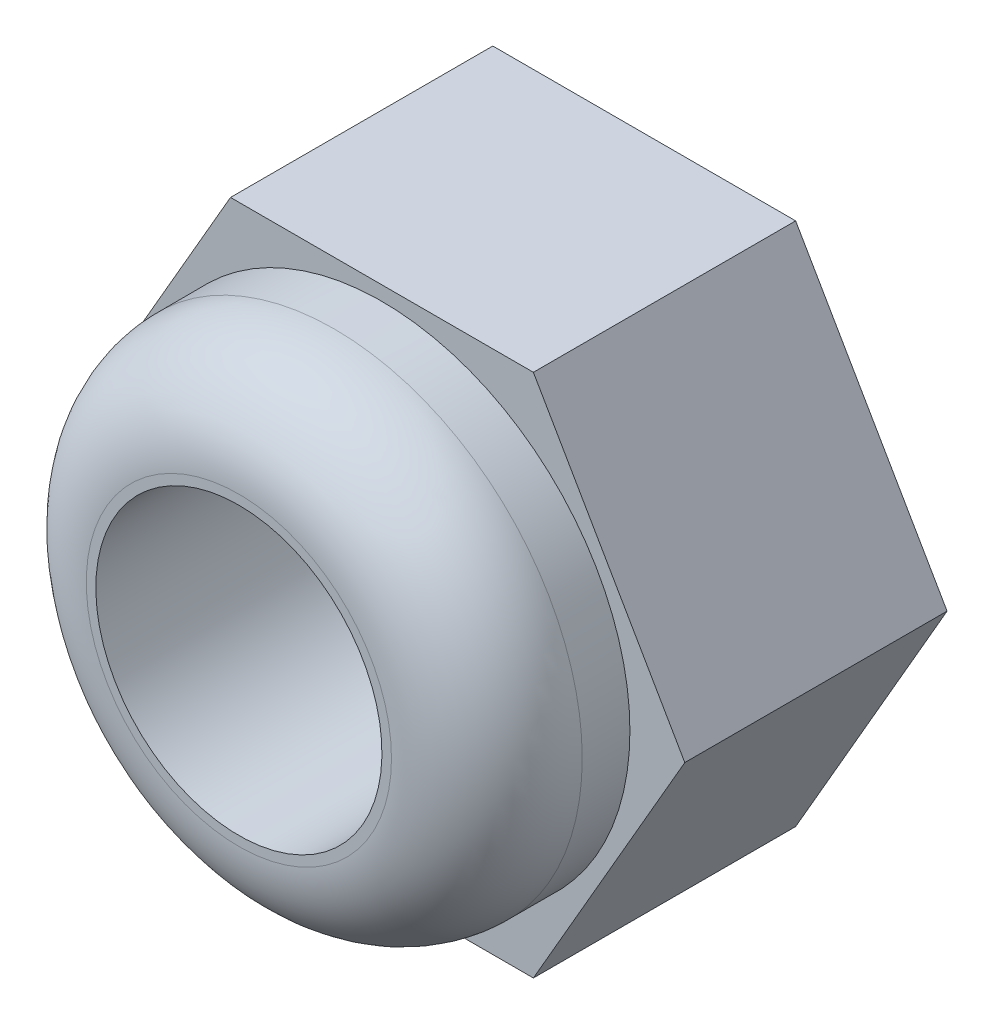
ISO-10303-21;
HEADER;
FILE_DESCRIPTION(('STEP AP214'),'2;1');
FILE_NAME('part.step','',(''),(''),'','','');
FILE_SCHEMA(('AUTOMOTIVE_DESIGN { 1 0 10303 214 1 1 1 1 }'));
ENDSEC;
DATA;
#1=APPLICATION_CONTEXT('core data for automotive mechanical design processes');
#2=APPLICATION_PROTOCOL_DEFINITION('international standard','automotive_design',2000,#1);
#3=PRODUCT_CONTEXT('',#1,'mechanical');
#4=PRODUCT('Part','Part','',(#3));
#5=PRODUCT_RELATED_PRODUCT_CATEGORY('part','',(#4));
#6=PRODUCT_DEFINITION_FORMATION('','',#4);
#7=PRODUCT_DEFINITION_CONTEXT('part definition',#1,'design');
#8=PRODUCT_DEFINITION('design','',#6,#7);
#9=PRODUCT_DEFINITION_SHAPE('','',#8);
#10=(LENGTH_UNIT() NAMED_UNIT(*) SI_UNIT(.MILLI.,.METRE.));
#11=(NAMED_UNIT(*) PLANE_ANGLE_UNIT() SI_UNIT($,.RADIAN.));
#12=(NAMED_UNIT(*) SI_UNIT($,.STERADIAN.) SOLID_ANGLE_UNIT());
#13=UNCERTAINTY_MEASURE_WITH_UNIT(LENGTH_MEASURE(1.E-05),#10,'distance_accuracy_value','');
#14=(GEOMETRIC_REPRESENTATION_CONTEXT(3) GLOBAL_UNCERTAINTY_ASSIGNED_CONTEXT((#13)) GLOBAL_UNIT_ASSIGNED_CONTEXT((#10,
#11,#12)) REPRESENTATION_CONTEXT('',''));
#15=CARTESIAN_POINT('',(0.,0.,0.));
#16=DIRECTION('',(0.,0.,1.));
#17=DIRECTION('',(1.,0.,0.));
#18=AXIS2_PLACEMENT_3D('',#15,#16,#17);
#19=CARTESIAN_POINT('',(0.,0.,2.75));
#20=DIRECTION('',(0.,0.,1.));
#21=DIRECTION('',(1.,0.,0.));
#22=AXIS2_PLACEMENT_3D('',#19,#20,#21);
#23=PLANE('',#22);
#24=CARTESIAN_POINT('',(0.,0.,2.75));
#25=DIRECTION('',(0.,0.,1.));
#26=DIRECTION('',(1.,0.,0.));
#27=AXIS2_PLACEMENT_3D('',#24,#25,#26);
#28=CIRCLE('',#27,2.6);
#29=CARTESIAN_POINT('',(2.6,0.,2.75));
#30=VERTEX_POINT('',#29);
#31=EDGE_CURVE('E20',#30,#30,#28,.T.);
#32=ORIENTED_EDGE('',*,*,#31,.F.);
#33=EDGE_LOOP('',(#32));
#34=FACE_BOUND('',#33,.T.);
#35=DIRECTION('',(0.5,0.866025403784439,0.));
#36=VECTOR('',#35,1.);
#37=CARTESIAN_POINT('',(3.17542648054294,0.,2.75));
#38=LINE('',#37,#36);
#39=CARTESIAN_POINT('',(3.17542648054294,0.,2.75));
#40=VERTEX_POINT('',#39);
#41=CARTESIAN_POINT('',(1.58771324027147,-2.75,2.75));
#42=VERTEX_POINT('',#41);
#43=EDGE_CURVE('E67',#40,#42,#38,.F.);
#44=ORIENTED_EDGE('',*,*,#43,.F.);
#45=DIRECTION('',(-0.500000000000001,0.866025403784438,0.));
#46=VECTOR('',#45,1.);
#47=CARTESIAN_POINT('',(1.58771324027147,2.75,2.75));
#48=LINE('',#47,#46);
#49=CARTESIAN_POINT('',(1.58771324027147,2.75,2.75));
#50=VERTEX_POINT('',#49);
#51=EDGE_CURVE('E157',#50,#40,#48,.F.);
#52=ORIENTED_EDGE('',*,*,#51,.F.);
#53=DIRECTION('',(1.,0.,0.));
#54=VECTOR('',#53,1.);
#55=CARTESIAN_POINT('',(-1.58771324027147,2.75,2.75));
#56=LINE('',#55,#54);
#57=CARTESIAN_POINT('',(-1.58771324027147,2.75,2.75));
#58=VERTEX_POINT('',#57);
#59=EDGE_CURVE('E153',#58,#50,#56,.T.);
#60=ORIENTED_EDGE('',*,*,#59,.F.);
#61=DIRECTION('',(-0.499999999999999,-0.866025403784439,0.));
#62=VECTOR('',#61,1.);
#63=CARTESIAN_POINT('',(-3.17542648054294,0.,2.75));
#64=LINE('',#63,#62);
#65=CARTESIAN_POINT('',(-3.17542648054294,0.,2.75));
#66=VERTEX_POINT('',#65);
#67=EDGE_CURVE('E85',#66,#58,#64,.F.);
#68=ORIENTED_EDGE('',*,*,#67,.F.);
#69=DIRECTION('',(0.500000000000001,-0.866025403784438,0.));
#70=VECTOR('',#69,1.);
#71=CARTESIAN_POINT('',(-1.58771324027147,-2.75,2.75));
#72=LINE('',#71,#70);
#73=CARTESIAN_POINT('',(-1.58771324027147,-2.75,2.75));
#74=VERTEX_POINT('',#73);
#75=EDGE_CURVE('E81',#74,#66,#72,.F.);
#76=ORIENTED_EDGE('',*,*,#75,.F.);
#77=DIRECTION('',(1.,0.,0.));
#78=VECTOR('',#77,1.);
#79=CARTESIAN_POINT('',(1.58771324027147,-2.75,2.75));
#80=LINE('',#79,#78);
#81=EDGE_CURVE('E72',#42,#74,#80,.F.);
#82=ORIENTED_EDGE('',*,*,#81,.F.);
#83=EDGE_LOOP('',(#44,#52,#60,#68,#76,#82));
#84=FACE_BOUND('',#83,.T.);
#85=ADVANCED_FACE('F16',(#34,#84),#23,.T.);
#86=CARTESIAN_POINT('',(0.,0.,2.75));
#87=DIRECTION('',(0.,0.,1.));
#88=DIRECTION('',(1.,0.,0.));
#89=AXIS2_PLACEMENT_3D('',#86,#87,#88);
#90=CYLINDRICAL_SURFACE('',#89,2.6);
#91=CARTESIAN_POINT('',(0.,0.,3.25));
#92=DIRECTION('',(0.,0.,-1.));
#93=DIRECTION('',(-1.,0.,0.));
#94=AXIS2_PLACEMENT_3D('',#91,#92,#93);
#95=CIRCLE('',#94,2.6);
#96=CARTESIAN_POINT('',(-2.6,0.,3.25));
#97=VERTEX_POINT('',#96);
#98=EDGE_CURVE('E124',#97,#97,#95,.F.);
#99=ORIENTED_EDGE('',*,*,#98,.F.);
#100=EDGE_LOOP('',(#99));
#101=FACE_BOUND('',#100,.T.);
#102=ORIENTED_EDGE('',*,*,#31,.T.);
#103=EDGE_LOOP('',(#102));
#104=FACE_BOUND('',#103,.T.);
#105=ADVANCED_FACE('F240',(#101,#104),#90,.T.);
#106=CARTESIAN_POINT('',(-1.58771324027147,-2.75,0.));
#107=DIRECTION('',(-0.866025403784438,-0.500000000000001,0.));
#108=DIRECTION('',(0.500000000000001,-0.866025403784438,0.));
#109=AXIS2_PLACEMENT_3D('',#106,#107,#108);
#110=PLANE('',#109);
#111=DIRECTION('',(0.500000000000001,-0.866025403784438,0.));
#112=VECTOR('',#111,1.);
#113=CARTESIAN_POINT('',(-3.17542648054294,0.,0.));
#114=LINE('',#113,#112);
#115=CARTESIAN_POINT('',(-3.17542648054294,0.,0.));
#116=VERTEX_POINT('',#115);
#117=CARTESIAN_POINT('',(-1.58771324027147,-2.75,0.));
#118=VERTEX_POINT('',#117);
#119=EDGE_CURVE('E92',#116,#118,#114,.T.);
#120=ORIENTED_EDGE('',*,*,#119,.T.);
#121=DIRECTION('',(0.,0.,-1.));
#122=VECTOR('',#121,1.);
#123=CARTESIAN_POINT('',(-1.58771324027147,-2.75,0.));
#124=LINE('',#123,#122);
#125=EDGE_CURVE('E77',#74,#118,#124,.T.);
#126=ORIENTED_EDGE('',*,*,#125,.F.);
#127=ORIENTED_EDGE('',*,*,#75,.T.);
#128=DIRECTION('',(0.,0.,1.));
#129=VECTOR('',#128,1.);
#130=CARTESIAN_POINT('',(-3.17542648054294,0.,0.));
#131=LINE('',#130,#129);
#132=EDGE_CURVE('E142',#116,#66,#131,.T.);
#133=ORIENTED_EDGE('',*,*,#132,.F.);
#134=EDGE_LOOP('',(#120,#126,#127,#133));
#135=FACE_BOUND('',#134,.T.);
#136=ADVANCED_FACE('F91',(#135),#110,.T.);
#137=CARTESIAN_POINT('',(1.58771324027147,-2.75,0.));
#138=DIRECTION('',(0.,-1.,0.));
#139=DIRECTION('',(0.,0.,-1.));
#140=AXIS2_PLACEMENT_3D('',#137,#138,#139);
#141=PLANE('',#140);
#142=DIRECTION('',(1.,0.,0.));
#143=VECTOR('',#142,1.);
#144=CARTESIAN_POINT('',(0.,-2.75,0.));
#145=LINE('',#144,#143);
#146=CARTESIAN_POINT('',(1.58771324027147,-2.75,0.));
#147=VERTEX_POINT('',#146);
#148=EDGE_CURVE('E121',#118,#147,#145,.T.);
#149=ORIENTED_EDGE('',*,*,#148,.T.);
#150=DIRECTION('',(0.,0.,1.));
#151=VECTOR('',#150,1.);
#152=CARTESIAN_POINT('',(1.58771324027147,-2.75,0.));
#153=LINE('',#152,#151);
#154=EDGE_CURVE('E79',#42,#147,#153,.F.);
#155=ORIENTED_EDGE('',*,*,#154,.F.);
#156=ORIENTED_EDGE('',*,*,#81,.T.);
#157=ORIENTED_EDGE('',*,*,#125,.T.);
#158=EDGE_LOOP('',(#149,#155,#156,#157));
#159=FACE_BOUND('',#158,.T.);
#160=ADVANCED_FACE('F75',(#159),#141,.T.);
#161=CARTESIAN_POINT('',(3.17542648054294,0.,0.));
#162=DIRECTION('',(0.866025403784439,-0.5,0.));
#163=DIRECTION('',(0.5,0.866025403784439,0.));
#164=AXIS2_PLACEMENT_3D('',#161,#162,#163);
#165=PLANE('',#164);
#166=DIRECTION('',(0.499999999999999,0.866025403784439,0.));
#167=VECTOR('',#166,1.);
#168=CARTESIAN_POINT('',(1.58771324027147,-2.75,0.));
#169=LINE('',#168,#167);
#170=CARTESIAN_POINT('',(3.17542648054294,0.,0.));
#171=VERTEX_POINT('',#170);
#172=EDGE_CURVE('E118',#147,#171,#169,.T.);
#173=ORIENTED_EDGE('',*,*,#172,.T.);
#174=DIRECTION('',(0.,0.,1.));
#175=VECTOR('',#174,1.);
#176=CARTESIAN_POINT('',(3.17542648054294,0.,0.));
#177=LINE('',#176,#175);
#178=EDGE_CURVE('E155',#40,#171,#177,.F.);
#179=ORIENTED_EDGE('',*,*,#178,.F.);
#180=ORIENTED_EDGE('',*,*,#43,.T.);
#181=ORIENTED_EDGE('',*,*,#154,.T.);
#182=EDGE_LOOP('',(#173,#179,#180,#181));
#183=FACE_BOUND('',#182,.T.);
#184=ADVANCED_FACE('F159',(#183),#165,.T.);
#185=CARTESIAN_POINT('',(1.58771324027147,2.75,0.));
#186=DIRECTION('',(0.866025403784438,0.500000000000001,0.));
#187=DIRECTION('',(-0.500000000000001,0.866025403784438,0.));
#188=AXIS2_PLACEMENT_3D('',#185,#186,#187);
#189=PLANE('',#188);
#190=DIRECTION('',(-0.500000000000001,0.866025403784438,0.));
#191=VECTOR('',#190,1.);
#192=CARTESIAN_POINT('',(3.17542648054294,0.,0.));
#193=LINE('',#192,#191);
#194=CARTESIAN_POINT('',(1.58771324027147,2.75,0.));
#195=VERTEX_POINT('',#194);
#196=EDGE_CURVE('E108',#171,#195,#193,.T.);
#197=ORIENTED_EDGE('',*,*,#196,.T.);
#198=DIRECTION('',(0.,0.,1.));
#199=VECTOR('',#198,1.);
#200=CARTESIAN_POINT('',(1.58771324027147,2.75,0.));
#201=LINE('',#200,#199);
#202=EDGE_CURVE('E151',#50,#195,#201,.F.);
#203=ORIENTED_EDGE('',*,*,#202,.F.);
#204=ORIENTED_EDGE('',*,*,#51,.T.);
#205=ORIENTED_EDGE('',*,*,#178,.T.);
#206=EDGE_LOOP('',(#197,#203,#204,#205));
#207=FACE_BOUND('',#206,.T.);
#208=ADVANCED_FACE('F165',(#207),#189,.T.);
#209=CARTESIAN_POINT('',(-1.58771324027147,2.75,0.));
#210=DIRECTION('',(0.,1.,0.));
#211=DIRECTION('',(0.,0.,1.));
#212=AXIS2_PLACEMENT_3D('',#209,#210,#211);
#213=PLANE('',#212);
#214=DIRECTION('',(1.,0.,0.));
#215=VECTOR('',#214,1.);
#216=CARTESIAN_POINT('',(0.,2.75,0.));
#217=LINE('',#216,#215);
#218=CARTESIAN_POINT('',(-1.58771324027147,2.75,0.));
#219=VERTEX_POINT('',#218);
#220=EDGE_CURVE('E105',#195,#219,#217,.F.);
#221=ORIENTED_EDGE('',*,*,#220,.T.);
#222=DIRECTION('',(0.,0.,1.));
#223=VECTOR('',#222,1.);
#224=CARTESIAN_POINT('',(-1.58771324027147,2.75,0.));
#225=LINE('',#224,#223);
#226=EDGE_CURVE('E35',#58,#219,#225,.F.);
#227=ORIENTED_EDGE('',*,*,#226,.F.);
#228=ORIENTED_EDGE('',*,*,#59,.T.);
#229=ORIENTED_EDGE('',*,*,#202,.T.);
#230=EDGE_LOOP('',(#221,#227,#228,#229));
#231=FACE_BOUND('',#230,.T.);
#232=ADVANCED_FACE('F168',(#231),#213,.T.);
#233=CARTESIAN_POINT('',(-3.17542648054294,0.,0.));
#234=DIRECTION('',(-0.866025403784439,0.499999999999999,0.));
#235=DIRECTION('',(-0.499999999999999,-0.866025403784439,0.));
#236=AXIS2_PLACEMENT_3D('',#233,#234,#235);
#237=PLANE('',#236);
#238=DIRECTION('',(-0.499999999999999,-0.866025403784439,0.));
#239=VECTOR('',#238,1.);
#240=CARTESIAN_POINT('',(-1.58771324027147,2.75,0.));
#241=LINE('',#240,#239);
#242=EDGE_CURVE('E101',#219,#116,#241,.T.);
#243=ORIENTED_EDGE('',*,*,#242,.T.);
#244=ORIENTED_EDGE('',*,*,#132,.T.);
#245=ORIENTED_EDGE('',*,*,#67,.T.);
#246=ORIENTED_EDGE('',*,*,#226,.T.);
#247=EDGE_LOOP('',(#243,#244,#245,#246));
#248=FACE_BOUND('',#247,.T.);
#249=ADVANCED_FACE('F135',(#248),#237,.T.);
#250=CARTESIAN_POINT('',(0.,0.,3.25));
#251=DIRECTION('',(0.,0.,-1.));
#252=DIRECTION('',(-1.,0.,0.));
#253=AXIS2_PLACEMENT_3D('',#250,#251,#252);
#254=TOROIDAL_SURFACE('',#253,1.6,1.);
#255=ORIENTED_EDGE('',*,*,#98,.T.);
#256=EDGE_LOOP('',(#255));
#257=FACE_BOUND('',#256,.T.);
#258=CARTESIAN_POINT('',(0.,0.,4.25));
#259=DIRECTION('',(0.,0.,-1.));
#260=DIRECTION('',(1.,0.,0.));
#261=AXIS2_PLACEMENT_3D('',#258,#259,#260);
#262=CIRCLE('',#261,1.6);
#263=CARTESIAN_POINT('',(1.6,0.,4.25));
#264=VERTEX_POINT('',#263);
#265=EDGE_CURVE('E97',#264,#264,#262,.T.);
#266=ORIENTED_EDGE('',*,*,#265,.T.);
#267=EDGE_LOOP('',(#266));
#268=FACE_BOUND('',#267,.T.);
#269=ADVANCED_FACE('F129',(#257,#268),#254,.T.);
#270=CARTESIAN_POINT('',(0.,0.,0.));
#271=DIRECTION('',(0.,0.,1.));
#272=DIRECTION('',(1.,0.,0.));
#273=AXIS2_PLACEMENT_3D('',#270,#271,#272);
#274=PLANE('',#273);
#275=CARTESIAN_POINT('',(0.,0.,0.));
#276=DIRECTION('',(0.,0.,-1.));
#277=DIRECTION('',(0.,1.,0.));
#278=AXIS2_PLACEMENT_3D('',#275,#276,#277);
#279=CIRCLE('',#278,1.5);
#280=CARTESIAN_POINT('',(0.,1.5,0.));
#281=VERTEX_POINT('',#280);
#282=EDGE_CURVE('E26',#281,#281,#279,.F.);
#283=ORIENTED_EDGE('',*,*,#282,.T.);
#284=EDGE_LOOP('',(#283));
#285=FACE_BOUND('',#284,.T.);
#286=ORIENTED_EDGE('',*,*,#220,.F.);
#287=ORIENTED_EDGE('',*,*,#196,.F.);
#288=ORIENTED_EDGE('',*,*,#172,.F.);
#289=ORIENTED_EDGE('',*,*,#148,.F.);
#290=ORIENTED_EDGE('',*,*,#119,.F.);
#291=ORIENTED_EDGE('',*,*,#242,.F.);
#292=EDGE_LOOP('',(#286,#287,#288,#289,#290,#291));
#293=FACE_BOUND('',#292,.T.);
#294=ADVANCED_FACE('F134',(#285,#293),#274,.F.);
#295=CARTESIAN_POINT('',(0.,0.,4.25));
#296=DIRECTION('',(0.,0.,-1.));
#297=DIRECTION('',(-1.,0.,0.));
#298=AXIS2_PLACEMENT_3D('',#295,#296,#297);
#299=PLANE('',#298);
#300=CARTESIAN_POINT('',(0.,0.,4.25));
#301=DIRECTION('',(0.,0.,-1.));
#302=DIRECTION('',(0.,1.,0.));
#303=AXIS2_PLACEMENT_3D('',#300,#301,#302);
#304=CIRCLE('',#303,1.5);
#305=CARTESIAN_POINT('',(0.,1.5,4.25));
#306=VERTEX_POINT('',#305);
#307=EDGE_CURVE('E11',#306,#306,#304,.T.);
#308=ORIENTED_EDGE('',*,*,#307,.T.);
#309=EDGE_LOOP('',(#308));
#310=FACE_BOUND('',#309,.T.);
#311=ORIENTED_EDGE('',*,*,#265,.F.);
#312=EDGE_LOOP('',(#311));
#313=FACE_BOUND('',#312,.T.);
#314=ADVANCED_FACE('F177',(#310,#313),#299,.F.);
#315=CARTESIAN_POINT('',(0.,0.,4.25));
#316=DIRECTION('',(0.,0.,-1.));
#317=DIRECTION('',(0.,1.,0.));
#318=AXIS2_PLACEMENT_3D('',#315,#316,#317);
#319=CYLINDRICAL_SURFACE('',#318,1.5);
#320=ORIENTED_EDGE('',*,*,#307,.F.);
#321=EDGE_LOOP('',(#320));
#322=FACE_BOUND('',#321,.T.);
#323=ORIENTED_EDGE('',*,*,#282,.F.);
#324=EDGE_LOOP('',(#323));
#325=FACE_BOUND('',#324,.T.);
#326=ADVANCED_FACE('F18',(#322,#325),#319,.F.);
#327=CLOSED_SHELL('',(#85,#105,#136,#160,#184,#208,#232,#249,#269,#294,#314,#326));
#328=MANIFOLD_SOLID_BREP('B1',#327);
#329=ADVANCED_BREP_SHAPE_REPRESENTATION('',(#18,#328),#14);
#330=SHAPE_DEFINITION_REPRESENTATION(#9,#329);
ENDSEC;
END-ISO-10303-21;
